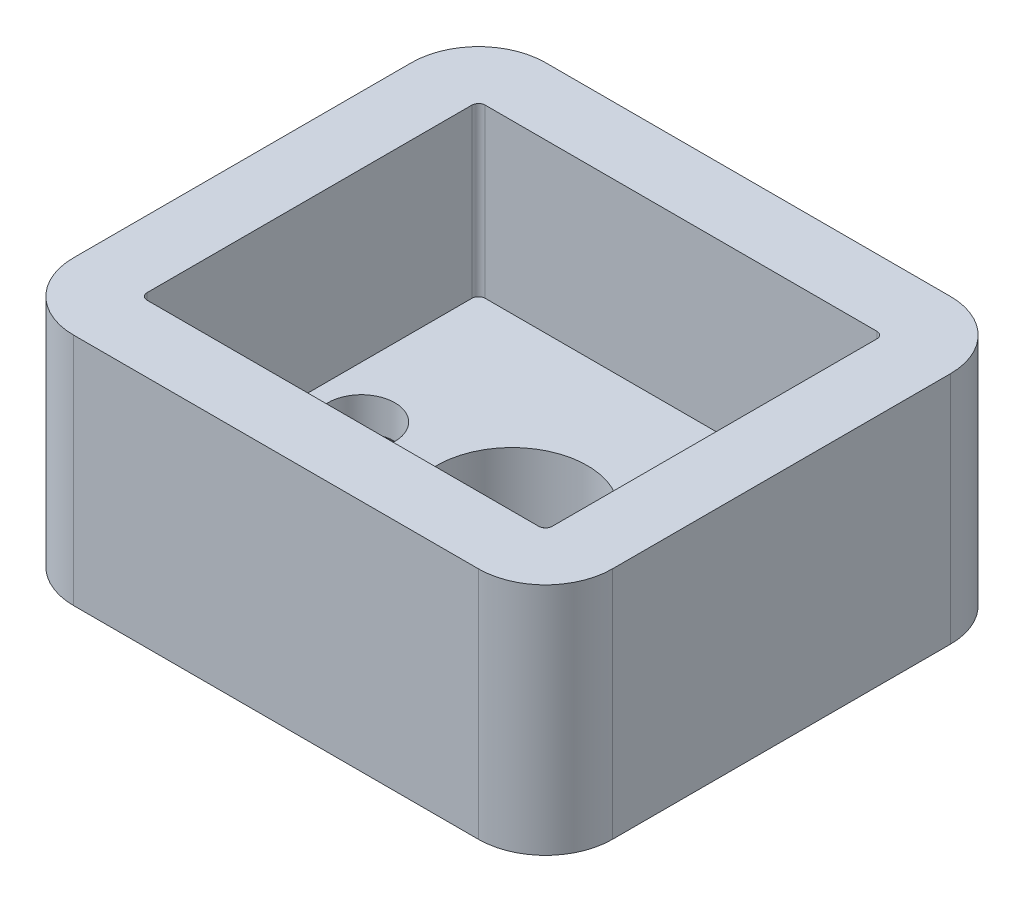
ISO-10303-21;
HEADER;
FILE_DESCRIPTION(('STEP AP214'),'2;1');
FILE_NAME('part.step','',(''),(''),'','','');
FILE_SCHEMA(('AUTOMOTIVE_DESIGN { 1 0 10303 214 1 1 1 1 }'));
ENDSEC;
DATA;
#1=APPLICATION_CONTEXT('core data for automotive mechanical design processes');
#2=APPLICATION_PROTOCOL_DEFINITION('international standard','automotive_design',2000,#1);
#3=PRODUCT_CONTEXT('',#1,'mechanical');
#4=PRODUCT('Part','Part','',(#3));
#5=PRODUCT_RELATED_PRODUCT_CATEGORY('part','',(#4));
#6=PRODUCT_DEFINITION_FORMATION('','',#4);
#7=PRODUCT_DEFINITION_CONTEXT('part definition',#1,'design');
#8=PRODUCT_DEFINITION('design','',#6,#7);
#9=PRODUCT_DEFINITION_SHAPE('','',#8);
#10=(LENGTH_UNIT() NAMED_UNIT(*) SI_UNIT(.MILLI.,.METRE.));
#11=(NAMED_UNIT(*) PLANE_ANGLE_UNIT() SI_UNIT($,.RADIAN.));
#12=(NAMED_UNIT(*) SI_UNIT($,.STERADIAN.) SOLID_ANGLE_UNIT());
#13=UNCERTAINTY_MEASURE_WITH_UNIT(LENGTH_MEASURE(1.E-05),#10,'distance_accuracy_value','');
#14=(GEOMETRIC_REPRESENTATION_CONTEXT(3) GLOBAL_UNCERTAINTY_ASSIGNED_CONTEXT((#13)) GLOBAL_UNIT_ASSIGNED_CONTEXT((#10,
#11,#12)) REPRESENTATION_CONTEXT('',''));
#15=CARTESIAN_POINT('',(0.,0.,0.));
#16=DIRECTION('',(0.,0.,1.));
#17=DIRECTION('',(1.,0.,0.));
#18=AXIS2_PLACEMENT_3D('',#15,#16,#17);
#19=CARTESIAN_POINT('',(0.,0.,0.));
#20=DIRECTION('',(0.,1.,0.));
#21=DIRECTION('',(0.,0.,1.));
#22=AXIS2_PLACEMENT_3D('',#19,#20,#21);
#23=PLANE('',#22);
#24=CARTESIAN_POINT('',(0.,0.,0.));
#25=DIRECTION('',(0.,1.,0.));
#26=DIRECTION('',(0.,0.,1.));
#27=AXIS2_PLACEMENT_3D('',#24,#25,#26);
#28=CIRCLE('',#27,2.25);
#29=CARTESIAN_POINT('',(0.,0.,2.25));
#30=VERTEX_POINT('',#29);
#31=EDGE_CURVE('E622',#30,#30,#28,.T.);
#32=ORIENTED_EDGE('',*,*,#31,.T.);
#33=EDGE_LOOP('',(#32));
#34=FACE_BOUND('',#33,.T.);
#35=DIRECTION('',(0.,0.,1.));
#36=VECTOR('',#35,1.);
#37=CARTESIAN_POINT('',(-8.05,0.,-7.05));
#38=LINE('',#37,#36);
#39=CARTESIAN_POINT('',(-8.05,0.,-5.05));
#40=VERTEX_POINT('',#39);
#41=CARTESIAN_POINT('',(-8.05,0.,5.05));
#42=VERTEX_POINT('',#41);
#43=EDGE_CURVE('E171',#40,#42,#38,.T.);
#44=ORIENTED_EDGE('',*,*,#43,.F.);
#45=CARTESIAN_POINT('',(-6.05,0.,-5.05));
#46=DIRECTION('',(0.,1.,0.));
#47=DIRECTION('',(0.,0.,1.));
#48=AXIS2_PLACEMENT_3D('',#45,#46,#47);
#49=CIRCLE('',#48,2.);
#50=CARTESIAN_POINT('',(-6.05,0.,-7.05));
#51=VERTEX_POINT('',#50);
#52=EDGE_CURVE('E153',#40,#51,#49,.F.);
#53=ORIENTED_EDGE('',*,*,#52,.T.);
#54=DIRECTION('',(-1.,0.,0.));
#55=VECTOR('',#54,1.);
#56=CARTESIAN_POINT('',(-8.05,0.,-7.05));
#57=LINE('',#56,#55);
#58=CARTESIAN_POINT('',(6.05,0.,-7.05));
#59=VERTEX_POINT('',#58);
#60=EDGE_CURVE('E201',#59,#51,#57,.T.);
#61=ORIENTED_EDGE('',*,*,#60,.F.);
#62=CARTESIAN_POINT('',(6.05,0.,-5.05));
#63=DIRECTION('',(0.,1.,0.));
#64=DIRECTION('',(0.,0.,1.));
#65=AXIS2_PLACEMENT_3D('',#62,#63,#64);
#66=CIRCLE('',#65,2.);
#67=CARTESIAN_POINT('',(8.05,0.,-5.05));
#68=VERTEX_POINT('',#67);
#69=EDGE_CURVE('E176',#59,#68,#66,.F.);
#70=ORIENTED_EDGE('',*,*,#69,.T.);
#71=DIRECTION('',(0.,0.,-1.));
#72=VECTOR('',#71,1.);
#73=CARTESIAN_POINT('',(8.05,0.,-7.05));
#74=LINE('',#73,#72);
#75=CARTESIAN_POINT('',(8.05,0.,5.05));
#76=VERTEX_POINT('',#75);
#77=EDGE_CURVE('E189',#76,#68,#74,.T.);
#78=ORIENTED_EDGE('',*,*,#77,.F.);
#79=CARTESIAN_POINT('',(6.05,0.,5.05));
#80=DIRECTION('',(0.,1.,0.));
#81=DIRECTION('',(0.,0.,1.));
#82=AXIS2_PLACEMENT_3D('',#79,#80,#81);
#83=CIRCLE('',#82,2.);
#84=CARTESIAN_POINT('',(6.05,0.,7.05));
#85=VERTEX_POINT('',#84);
#86=EDGE_CURVE('E165',#76,#85,#83,.F.);
#87=ORIENTED_EDGE('',*,*,#86,.T.);
#88=DIRECTION('',(1.,0.,0.));
#89=VECTOR('',#88,1.);
#90=CARTESIAN_POINT('',(-8.05,0.,7.05));
#91=LINE('',#90,#89);
#92=CARTESIAN_POINT('',(-6.05,0.,7.05));
#93=VERTEX_POINT('',#92);
#94=EDGE_CURVE('E183',#93,#85,#91,.T.);
#95=ORIENTED_EDGE('',*,*,#94,.F.);
#96=CARTESIAN_POINT('',(-6.05,0.,5.05));
#97=DIRECTION('',(0.,1.,0.));
#98=DIRECTION('',(0.,0.,1.));
#99=AXIS2_PLACEMENT_3D('',#96,#97,#98);
#100=CIRCLE('',#99,2.);
#101=EDGE_CURVE('E181',#93,#42,#100,.F.);
#102=ORIENTED_EDGE('',*,*,#101,.T.);
#103=EDGE_LOOP('',(#44,#53,#61,#70,#78,#87,#95,#102));
#104=FACE_BOUND('',#103,.T.);
#105=CARTESIAN_POINT('',(4.5,0.,0.));
#106=DIRECTION('',(0.,-1.,0.));
#107=DIRECTION('',(0.,0.,-1.));
#108=AXIS2_PLACEMENT_3D('',#105,#106,#107);
#109=CIRCLE('',#108,2.);
#110=CARTESIAN_POINT('',(4.5,0.,-2.));
#111=VERTEX_POINT('',#110);
#112=EDGE_CURVE('E606',#111,#111,#109,.T.);
#113=ORIENTED_EDGE('',*,*,#112,.F.);
#114=EDGE_LOOP('',(#113));
#115=FACE_BOUND('',#114,.T.);
#116=CARTESIAN_POINT('',(-4.5,0.,0.));
#117=DIRECTION('',(0.,-1.,0.));
#118=DIRECTION('',(0.,0.,-1.));
#119=AXIS2_PLACEMENT_3D('',#116,#117,#118);
#120=CIRCLE('',#119,2.);
#121=CARTESIAN_POINT('',(-4.5,0.,-2.));
#122=VERTEX_POINT('',#121);
#123=EDGE_CURVE('E618',#122,#122,#120,.T.);
#124=ORIENTED_EDGE('',*,*,#123,.F.);
#125=EDGE_LOOP('',(#124));
#126=FACE_BOUND('',#125,.T.);
#127=ADVANCED_FACE('F40',(#34,#104,#115,#126),#23,.F.);
#128=CARTESIAN_POINT('',(-8.05,7.,-7.05));
#129=DIRECTION('',(1.,0.,0.));
#130=DIRECTION('',(0.,0.,-1.));
#131=AXIS2_PLACEMENT_3D('',#128,#129,#130);
#132=PLANE('',#131);
#133=DIRECTION('',(0.,0.,1.));
#134=VECTOR('',#133,1.);
#135=CARTESIAN_POINT('',(-8.05,7.,-7.05));
#136=LINE('',#135,#134);
#137=CARTESIAN_POINT('',(-8.05,7.,-5.05));
#138=VERTEX_POINT('',#137);
#139=CARTESIAN_POINT('',(-8.05,7.,5.05));
#140=VERTEX_POINT('',#139);
#141=EDGE_CURVE('E174',#138,#140,#136,.T.);
#142=ORIENTED_EDGE('',*,*,#141,.F.);
#143=DIRECTION('',(0.,-1.,0.));
#144=VECTOR('',#143,1.);
#145=CARTESIAN_POINT('',(-8.05,7.,-5.05));
#146=LINE('',#145,#144);
#147=EDGE_CURVE('E157',#138,#40,#146,.T.);
#148=ORIENTED_EDGE('',*,*,#147,.T.);
#149=ORIENTED_EDGE('',*,*,#43,.T.);
#150=DIRECTION('',(0.,-1.,0.));
#151=VECTOR('',#150,1.);
#152=CARTESIAN_POINT('',(-8.05,7.,5.05));
#153=LINE('',#152,#151);
#154=EDGE_CURVE('E177',#42,#140,#153,.F.);
#155=ORIENTED_EDGE('',*,*,#154,.T.);
#156=EDGE_LOOP('',(#142,#148,#149,#155));
#157=FACE_BOUND('',#156,.T.);
#158=ADVANCED_FACE('F170',(#157),#132,.F.);
#159=CARTESIAN_POINT('',(-8.05,7.,7.05));
#160=DIRECTION('',(0.,0.,-1.));
#161=DIRECTION('',(-1.,0.,0.));
#162=AXIS2_PLACEMENT_3D('',#159,#160,#161);
#163=PLANE('',#162);
#164=ORIENTED_EDGE('',*,*,#94,.T.);
#165=DIRECTION('',(0.,-1.,0.));
#166=VECTOR('',#165,1.);
#167=CARTESIAN_POINT('',(6.05,7.,7.05));
#168=LINE('',#167,#166);
#169=CARTESIAN_POINT('',(6.05,7.,7.05));
#170=VERTEX_POINT('',#169);
#171=EDGE_CURVE('E240',#85,#170,#168,.F.);
#172=ORIENTED_EDGE('',*,*,#171,.T.);
#173=DIRECTION('',(1.,0.,0.));
#174=VECTOR('',#173,1.);
#175=CARTESIAN_POINT('',(-8.05,7.,7.05));
#176=LINE('',#175,#174);
#177=CARTESIAN_POINT('',(-6.05,7.,7.05));
#178=VERTEX_POINT('',#177);
#179=EDGE_CURVE('E344',#178,#170,#176,.T.);
#180=ORIENTED_EDGE('',*,*,#179,.F.);
#181=DIRECTION('',(0.,-1.,0.));
#182=VECTOR('',#181,1.);
#183=CARTESIAN_POINT('',(-6.05,7.,7.05));
#184=LINE('',#183,#182);
#185=EDGE_CURVE('E236',#178,#93,#184,.T.);
#186=ORIENTED_EDGE('',*,*,#185,.T.);
#187=EDGE_LOOP('',(#164,#172,#180,#186));
#188=FACE_BOUND('',#187,.T.);
#189=ADVANCED_FACE('F370',(#188),#163,.F.);
#190=CARTESIAN_POINT('',(8.05,7.,-7.05));
#191=DIRECTION('',(-1.,0.,0.));
#192=DIRECTION('',(0.,0.,1.));
#193=AXIS2_PLACEMENT_3D('',#190,#191,#192);
#194=PLANE('',#193);
#195=DIRECTION('',(0.,0.,-1.));
#196=VECTOR('',#195,1.);
#197=CARTESIAN_POINT('',(8.05,7.,-7.05));
#198=LINE('',#197,#196);
#199=CARTESIAN_POINT('',(8.05,7.,5.05));
#200=VERTEX_POINT('',#199);
#201=CARTESIAN_POINT('',(8.05,7.,-5.05));
#202=VERTEX_POINT('',#201);
#203=EDGE_CURVE('E347',#200,#202,#198,.T.);
#204=ORIENTED_EDGE('',*,*,#203,.F.);
#205=DIRECTION('',(0.,-1.,0.));
#206=VECTOR('',#205,1.);
#207=CARTESIAN_POINT('',(8.05,7.,5.05));
#208=LINE('',#207,#206);
#209=EDGE_CURVE('E232',#200,#76,#208,.T.);
#210=ORIENTED_EDGE('',*,*,#209,.T.);
#211=ORIENTED_EDGE('',*,*,#77,.T.);
#212=DIRECTION('',(0.,-1.,0.));
#213=VECTOR('',#212,1.);
#214=CARTESIAN_POINT('',(8.05,7.,-5.05));
#215=LINE('',#214,#213);
#216=EDGE_CURVE('E229',#68,#202,#215,.F.);
#217=ORIENTED_EDGE('',*,*,#216,.T.);
#218=EDGE_LOOP('',(#204,#210,#211,#217));
#219=FACE_BOUND('',#218,.T.);
#220=ADVANCED_FACE('F363',(#219),#194,.F.);
#221=CARTESIAN_POINT('',(-8.05,7.,-7.05));
#222=DIRECTION('',(0.,0.,1.));
#223=DIRECTION('',(1.,0.,0.));
#224=AXIS2_PLACEMENT_3D('',#221,#222,#223);
#225=PLANE('',#224);
#226=ORIENTED_EDGE('',*,*,#60,.T.);
#227=DIRECTION('',(0.,-1.,0.));
#228=VECTOR('',#227,1.);
#229=CARTESIAN_POINT('',(-6.05,7.,-7.05));
#230=LINE('',#229,#228);
#231=CARTESIAN_POINT('',(-6.05,7.,-7.05));
#232=VERTEX_POINT('',#231);
#233=EDGE_CURVE('E158',#51,#232,#230,.F.);
#234=ORIENTED_EDGE('',*,*,#233,.T.);
#235=DIRECTION('',(-1.,0.,0.));
#236=VECTOR('',#235,1.);
#237=CARTESIAN_POINT('',(-8.05,7.,-7.05));
#238=LINE('',#237,#236);
#239=CARTESIAN_POINT('',(6.05,7.,-7.05));
#240=VERTEX_POINT('',#239);
#241=EDGE_CURVE('E195',#240,#232,#238,.T.);
#242=ORIENTED_EDGE('',*,*,#241,.F.);
#243=DIRECTION('',(0.,-1.,0.));
#244=VECTOR('',#243,1.);
#245=CARTESIAN_POINT('',(6.05,7.,-7.05));
#246=LINE('',#245,#244);
#247=EDGE_CURVE('E164',#240,#59,#246,.T.);
#248=ORIENTED_EDGE('',*,*,#247,.T.);
#249=EDGE_LOOP('',(#226,#234,#242,#248));
#250=FACE_BOUND('',#249,.T.);
#251=ADVANCED_FACE('F357',(#250),#225,.F.);
#252=CARTESIAN_POINT('',(0.,7.,0.));
#253=DIRECTION('',(0.,1.,0.));
#254=DIRECTION('',(0.,0.,1.));
#255=AXIS2_PLACEMENT_3D('',#252,#253,#254);
#256=PLANE('',#255);
#257=DIRECTION('',(0.,0.,1.));
#258=VECTOR('',#257,1.);
#259=CARTESIAN_POINT('',(-6.05,7.,-5.05));
#260=LINE('',#259,#258);
#261=CARTESIAN_POINT('',(-6.05,7.,-4.85));
#262=VERTEX_POINT('',#261);
#263=CARTESIAN_POINT('',(-6.05,7.,4.85));
#264=VERTEX_POINT('',#263);
#265=EDGE_CURVE('E292',#262,#264,#260,.T.);
#266=ORIENTED_EDGE('',*,*,#265,.F.);
#267=CARTESIAN_POINT('',(-5.85,7.,-4.85));
#268=DIRECTION('',(0.,1.,0.));
#269=DIRECTION('',(0.,0.,1.));
#270=AXIS2_PLACEMENT_3D('',#267,#268,#269);
#271=CIRCLE('',#270,0.2);
#272=CARTESIAN_POINT('',(-5.85,7.,-5.05));
#273=VERTEX_POINT('',#272);
#274=EDGE_CURVE('E282',#262,#273,#271,.F.);
#275=ORIENTED_EDGE('',*,*,#274,.T.);
#276=DIRECTION('',(-1.,0.,0.));
#277=VECTOR('',#276,1.);
#278=CARTESIAN_POINT('',(-6.05,7.,-5.05));
#279=LINE('',#278,#277);
#280=CARTESIAN_POINT('',(5.85,7.,-5.05));
#281=VERTEX_POINT('',#280);
#282=EDGE_CURVE('E324',#281,#273,#279,.T.);
#283=ORIENTED_EDGE('',*,*,#282,.F.);
#284=CARTESIAN_POINT('',(5.85,7.,-4.85));
#285=DIRECTION('',(0.,1.,0.));
#286=DIRECTION('',(0.,0.,1.));
#287=AXIS2_PLACEMENT_3D('',#284,#285,#286);
#288=CIRCLE('',#287,0.2);
#289=CARTESIAN_POINT('',(6.05,7.,-4.85));
#290=VERTEX_POINT('',#289);
#291=EDGE_CURVE('E285',#281,#290,#288,.F.);
#292=ORIENTED_EDGE('',*,*,#291,.T.);
#293=DIRECTION('',(0.,0.,-1.));
#294=VECTOR('',#293,1.);
#295=CARTESIAN_POINT('',(6.05,7.,-5.05));
#296=LINE('',#295,#294);
#297=CARTESIAN_POINT('',(6.05,7.,4.85));
#298=VERTEX_POINT('',#297);
#299=EDGE_CURVE('E331',#298,#290,#296,.T.);
#300=ORIENTED_EDGE('',*,*,#299,.F.);
#301=CARTESIAN_POINT('',(5.85,7.,4.85));
#302=DIRECTION('',(0.,1.,0.));
#303=DIRECTION('',(0.,0.,1.));
#304=AXIS2_PLACEMENT_3D('',#301,#302,#303);
#305=CIRCLE('',#304,0.2);
#306=CARTESIAN_POINT('',(5.85,7.,5.05));
#307=VERTEX_POINT('',#306);
#308=EDGE_CURVE('E12',#298,#307,#305,.F.);
#309=ORIENTED_EDGE('',*,*,#308,.T.);
#310=DIRECTION('',(1.,0.,0.));
#311=VECTOR('',#310,1.);
#312=CARTESIAN_POINT('',(-6.05,7.,5.05));
#313=LINE('',#312,#311);
#314=CARTESIAN_POINT('',(-5.85,7.,5.05));
#315=VERTEX_POINT('',#314);
#316=EDGE_CURVE('E293',#315,#307,#313,.T.);
#317=ORIENTED_EDGE('',*,*,#316,.F.);
#318=CARTESIAN_POINT('',(-5.85,7.,4.85));
#319=DIRECTION('',(0.,1.,0.));
#320=DIRECTION('',(0.,0.,1.));
#321=AXIS2_PLACEMENT_3D('',#318,#319,#320);
#322=CIRCLE('',#321,0.2);
#323=EDGE_CURVE('E49',#315,#264,#322,.F.);
#324=ORIENTED_EDGE('',*,*,#323,.T.);
#325=EDGE_LOOP('',(#266,#275,#283,#292,#300,#309,#317,#324));
#326=FACE_BOUND('',#325,.T.);
#327=ORIENTED_EDGE('',*,*,#241,.T.);
#328=CARTESIAN_POINT('',(-6.05,7.,-5.05));
#329=DIRECTION('',(0.,1.,0.));
#330=DIRECTION('',(0.,0.,1.));
#331=AXIS2_PLACEMENT_3D('',#328,#329,#330);
#332=CIRCLE('',#331,2.);
#333=EDGE_CURVE('E226',#232,#138,#332,.T.);
#334=ORIENTED_EDGE('',*,*,#333,.T.);
#335=ORIENTED_EDGE('',*,*,#141,.T.);
#336=CARTESIAN_POINT('',(-6.05,7.,5.05));
#337=DIRECTION('',(0.,1.,0.));
#338=DIRECTION('',(0.,0.,1.));
#339=AXIS2_PLACEMENT_3D('',#336,#337,#338);
#340=CIRCLE('',#339,2.);
#341=EDGE_CURVE('E220',#140,#178,#340,.T.);
#342=ORIENTED_EDGE('',*,*,#341,.T.);
#343=ORIENTED_EDGE('',*,*,#179,.T.);
#344=CARTESIAN_POINT('',(6.05,7.,5.05));
#345=DIRECTION('',(0.,1.,0.));
#346=DIRECTION('',(0.,0.,1.));
#347=AXIS2_PLACEMENT_3D('',#344,#345,#346);
#348=CIRCLE('',#347,2.);
#349=EDGE_CURVE('E223',#170,#200,#348,.T.);
#350=ORIENTED_EDGE('',*,*,#349,.T.);
#351=ORIENTED_EDGE('',*,*,#203,.T.);
#352=CARTESIAN_POINT('',(6.05,7.,-5.05));
#353=DIRECTION('',(0.,1.,0.));
#354=DIRECTION('',(0.,0.,1.));
#355=AXIS2_PLACEMENT_3D('',#352,#353,#354);
#356=CIRCLE('',#355,2.);
#357=EDGE_CURVE('E217',#202,#240,#356,.T.);
#358=ORIENTED_EDGE('',*,*,#357,.T.);
#359=EDGE_LOOP('',(#327,#334,#335,#342,#343,#350,#351,#358));
#360=FACE_BOUND('',#359,.T.);
#361=ADVANCED_FACE('F290',(#326,#360),#256,.T.);
#362=CARTESIAN_POINT('',(-6.05,-15.7613451202618,-5.05));
#363=DIRECTION('',(-1.,0.,0.));
#364=DIRECTION('',(0.,0.,1.));
#365=AXIS2_PLACEMENT_3D('',#362,#363,#364);
#366=PLANE('',#365);
#367=DIRECTION('',(0.,0.,-1.));
#368=VECTOR('',#367,1.);
#369=CARTESIAN_POINT('',(-6.05,2.,-5.05));
#370=LINE('',#369,#368);
#371=CARTESIAN_POINT('',(-6.05,2.,4.85));
#372=VERTEX_POINT('',#371);
#373=CARTESIAN_POINT('',(-6.05,2.,-4.85));
#374=VERTEX_POINT('',#373);
#375=EDGE_CURVE('E192',#372,#374,#370,.T.);
#376=ORIENTED_EDGE('',*,*,#375,.T.);
#377=DIRECTION('',(0.,1.,0.));
#378=VECTOR('',#377,1.);
#379=CARTESIAN_POINT('',(-6.05,7.,-4.85));
#380=LINE('',#379,#378);
#381=EDGE_CURVE('E246',#374,#262,#380,.T.);
#382=ORIENTED_EDGE('',*,*,#381,.T.);
#383=ORIENTED_EDGE('',*,*,#265,.T.);
#384=DIRECTION('',(0.,1.,0.));
#385=VECTOR('',#384,1.);
#386=CARTESIAN_POINT('',(-6.05,2.,4.85));
#387=LINE('',#386,#385);
#388=EDGE_CURVE('E243',#264,#372,#387,.F.);
#389=ORIENTED_EDGE('',*,*,#388,.T.);
#390=EDGE_LOOP('',(#376,#382,#383,#389));
#391=FACE_BOUND('',#390,.T.);
#392=ADVANCED_FACE('F296',(#391),#366,.F.);
#393=CARTESIAN_POINT('',(-6.05,-15.7613451202618,-5.05));
#394=DIRECTION('',(0.,0.,-1.));
#395=DIRECTION('',(-1.,0.,0.));
#396=AXIS2_PLACEMENT_3D('',#393,#394,#395);
#397=PLANE('',#396);
#398=ORIENTED_EDGE('',*,*,#282,.T.);
#399=DIRECTION('',(0.,1.,0.));
#400=VECTOR('',#399,1.);
#401=CARTESIAN_POINT('',(-5.85,2.,-5.05));
#402=LINE('',#401,#400);
#403=CARTESIAN_POINT('',(-5.85,2.,-5.05));
#404=VERTEX_POINT('',#403);
#405=EDGE_CURVE('E254',#273,#404,#402,.F.);
#406=ORIENTED_EDGE('',*,*,#405,.T.);
#407=DIRECTION('',(1.,0.,0.));
#408=VECTOR('',#407,1.);
#409=CARTESIAN_POINT('',(-6.05,2.,-5.05));
#410=LINE('',#409,#408);
#411=CARTESIAN_POINT('',(5.85,2.,-5.05));
#412=VERTEX_POINT('',#411);
#413=EDGE_CURVE('E323',#404,#412,#410,.T.);
#414=ORIENTED_EDGE('',*,*,#413,.T.);
#415=DIRECTION('',(0.,1.,0.));
#416=VECTOR('',#415,1.);
#417=CARTESIAN_POINT('',(5.85,7.,-5.05));
#418=LINE('',#417,#416);
#419=EDGE_CURVE('E250',#412,#281,#418,.T.);
#420=ORIENTED_EDGE('',*,*,#419,.T.);
#421=EDGE_LOOP('',(#398,#406,#414,#420));
#422=FACE_BOUND('',#421,.T.);
#423=ADVANCED_FACE('F433',(#422),#397,.F.);
#424=CARTESIAN_POINT('',(6.05,-15.7613451202618,-5.05));
#425=DIRECTION('',(1.,0.,0.));
#426=DIRECTION('',(0.,0.,-1.));
#427=AXIS2_PLACEMENT_3D('',#424,#425,#426);
#428=PLANE('',#427);
#429=ORIENTED_EDGE('',*,*,#299,.T.);
#430=DIRECTION('',(0.,1.,0.));
#431=VECTOR('',#430,1.);
#432=CARTESIAN_POINT('',(6.05,2.,-4.85));
#433=LINE('',#432,#431);
#434=CARTESIAN_POINT('',(6.05,2.,-4.85));
#435=VERTEX_POINT('',#434);
#436=EDGE_CURVE('E273',#290,#435,#433,.F.);
#437=ORIENTED_EDGE('',*,*,#436,.T.);
#438=DIRECTION('',(0.,0.,1.));
#439=VECTOR('',#438,1.);
#440=CARTESIAN_POINT('',(6.05,2.,-5.05));
#441=LINE('',#440,#439);
#442=CARTESIAN_POINT('',(6.05,2.,4.85));
#443=VERTEX_POINT('',#442);
#444=EDGE_CURVE('E316',#435,#443,#441,.T.);
#445=ORIENTED_EDGE('',*,*,#444,.T.);
#446=DIRECTION('',(0.,1.,0.));
#447=VECTOR('',#446,1.);
#448=CARTESIAN_POINT('',(6.05,7.,4.85));
#449=LINE('',#448,#447);
#450=EDGE_CURVE('E269',#443,#298,#449,.T.);
#451=ORIENTED_EDGE('',*,*,#450,.T.);
#452=EDGE_LOOP('',(#429,#437,#445,#451));
#453=FACE_BOUND('',#452,.T.);
#454=ADVANCED_FACE('F320',(#453),#428,.F.);
#455=CARTESIAN_POINT('',(-6.05,-15.7613451202618,5.05));
#456=DIRECTION('',(0.,0.,1.));
#457=DIRECTION('',(1.,0.,0.));
#458=AXIS2_PLACEMENT_3D('',#455,#456,#457);
#459=PLANE('',#458);
#460=DIRECTION('',(-1.,0.,0.));
#461=VECTOR('',#460,1.);
#462=CARTESIAN_POINT('',(-6.05,2.,5.05));
#463=LINE('',#462,#461);
#464=CARTESIAN_POINT('',(5.85,2.,5.05));
#465=VERTEX_POINT('',#464);
#466=CARTESIAN_POINT('',(-5.85,2.,5.05));
#467=VERTEX_POINT('',#466);
#468=EDGE_CURVE('E184',#465,#467,#463,.T.);
#469=ORIENTED_EDGE('',*,*,#468,.T.);
#470=DIRECTION('',(0.,1.,0.));
#471=VECTOR('',#470,1.);
#472=CARTESIAN_POINT('',(-5.85,7.,5.05));
#473=LINE('',#472,#471);
#474=EDGE_CURVE('E279',#467,#315,#473,.T.);
#475=ORIENTED_EDGE('',*,*,#474,.T.);
#476=ORIENTED_EDGE('',*,*,#316,.T.);
#477=DIRECTION('',(0.,1.,0.));
#478=VECTOR('',#477,1.);
#479=CARTESIAN_POINT('',(5.85,2.,5.05));
#480=LINE('',#479,#478);
#481=EDGE_CURVE('E276',#307,#465,#480,.F.);
#482=ORIENTED_EDGE('',*,*,#481,.T.);
#483=EDGE_LOOP('',(#469,#475,#476,#482));
#484=FACE_BOUND('',#483,.T.);
#485=ADVANCED_FACE('F310',(#484),#459,.F.);
#486=CARTESIAN_POINT('',(0.,2.,0.));
#487=DIRECTION('',(0.,1.,0.));
#488=DIRECTION('',(0.,0.,1.));
#489=AXIS2_PLACEMENT_3D('',#486,#487,#488);
#490=PLANE('',#489);
#491=CARTESIAN_POINT('',(0.,2.,0.));
#492=DIRECTION('',(0.,1.,0.));
#493=DIRECTION('',(0.,0.,1.));
#494=AXIS2_PLACEMENT_3D('',#491,#492,#493);
#495=CIRCLE('',#494,2.25);
#496=CARTESIAN_POINT('',(0.,2.,2.25));
#497=VERTEX_POINT('',#496);
#498=EDGE_CURVE('E594',#497,#497,#495,.T.);
#499=ORIENTED_EDGE('',*,*,#498,.F.);
#500=EDGE_LOOP('',(#499));
#501=FACE_BOUND('',#500,.T.);
#502=CARTESIAN_POINT('',(-4.5,2.,0.));
#503=DIRECTION('',(0.,1.,0.));
#504=DIRECTION('',(0.,0.,1.));
#505=AXIS2_PLACEMENT_3D('',#502,#503,#504);
#506=CIRCLE('',#505,0.999999999999999);
#507=CARTESIAN_POINT('',(-4.5,2.,0.999999999999999));
#508=VERTEX_POINT('',#507);
#509=EDGE_CURVE('E598',#508,#508,#506,.T.);
#510=ORIENTED_EDGE('',*,*,#509,.F.);
#511=EDGE_LOOP('',(#510));
#512=FACE_BOUND('',#511,.T.);
#513=CARTESIAN_POINT('',(4.5,2.,0.));
#514=DIRECTION('',(0.,1.,0.));
#515=DIRECTION('',(0.,0.,1.));
#516=AXIS2_PLACEMENT_3D('',#513,#514,#515);
#517=CIRCLE('',#516,0.999999999999999);
#518=CARTESIAN_POINT('',(4.5,2.,0.999999999999999));
#519=VERTEX_POINT('',#518);
#520=EDGE_CURVE('E300',#519,#519,#517,.T.);
#521=ORIENTED_EDGE('',*,*,#520,.F.);
#522=EDGE_LOOP('',(#521));
#523=FACE_BOUND('',#522,.T.);
#524=ORIENTED_EDGE('',*,*,#413,.F.);
#525=CARTESIAN_POINT('',(-5.85,2.,-4.85));
#526=DIRECTION('',(0.,1.,0.));
#527=DIRECTION('',(0.,0.,1.));
#528=AXIS2_PLACEMENT_3D('',#525,#526,#527);
#529=CIRCLE('',#528,0.2);
#530=EDGE_CURVE('E266',#404,#374,#529,.T.);
#531=ORIENTED_EDGE('',*,*,#530,.T.);
#532=ORIENTED_EDGE('',*,*,#375,.F.);
#533=CARTESIAN_POINT('',(-5.85,2.,4.85));
#534=DIRECTION('',(0.,1.,0.));
#535=DIRECTION('',(0.,0.,1.));
#536=AXIS2_PLACEMENT_3D('',#533,#534,#535);
#537=CIRCLE('',#536,0.2);
#538=EDGE_CURVE('E260',#372,#467,#537,.T.);
#539=ORIENTED_EDGE('',*,*,#538,.T.);
#540=ORIENTED_EDGE('',*,*,#468,.F.);
#541=CARTESIAN_POINT('',(5.85,2.,4.85));
#542=DIRECTION('',(0.,1.,0.));
#543=DIRECTION('',(0.,0.,1.));
#544=AXIS2_PLACEMENT_3D('',#541,#542,#543);
#545=CIRCLE('',#544,0.2);
#546=EDGE_CURVE('E257',#465,#443,#545,.T.);
#547=ORIENTED_EDGE('',*,*,#546,.T.);
#548=ORIENTED_EDGE('',*,*,#444,.F.);
#549=CARTESIAN_POINT('',(5.85,2.,-4.85));
#550=DIRECTION('',(0.,1.,0.));
#551=DIRECTION('',(0.,0.,1.));
#552=AXIS2_PLACEMENT_3D('',#549,#550,#551);
#553=CIRCLE('',#552,0.2);
#554=EDGE_CURVE('E263',#435,#412,#553,.T.);
#555=ORIENTED_EDGE('',*,*,#554,.T.);
#556=EDGE_LOOP('',(#524,#531,#532,#539,#540,#547,#548,#555));
#557=FACE_BOUND('',#556,.T.);
#558=ADVANCED_FACE('F307',(#501,#512,#523,#557),#490,.T.);
#559=CARTESIAN_POINT('',(4.5,0.,0.));
#560=DIRECTION('',(0.,-1.,0.));
#561=DIRECTION('',(0.,0.,-1.));
#562=AXIS2_PLACEMENT_3D('',#559,#560,#561);
#563=CYLINDRICAL_SURFACE('',#562,0.999999999999999);
#564=CARTESIAN_POINT('',(4.5,1.,0.));
#565=DIRECTION('',(0.,-1.,0.));
#566=DIRECTION('',(0.,0.,-1.));
#567=AXIS2_PLACEMENT_3D('',#564,#565,#566);
#568=CIRCLE('',#567,0.999999999999999);
#569=CARTESIAN_POINT('',(4.5,1.,-0.999999999999999));
#570=VERTEX_POINT('',#569);
#571=EDGE_CURVE('E603',#570,#570,#568,.T.);
#572=ORIENTED_EDGE('',*,*,#571,.T.);
#573=EDGE_LOOP('',(#572));
#574=FACE_BOUND('',#573,.T.);
#575=ORIENTED_EDGE('',*,*,#520,.T.);
#576=EDGE_LOOP('',(#575));
#577=FACE_BOUND('',#576,.T.);
#578=ADVANCED_FACE('F425',(#574,#577),#563,.F.);
#579=CARTESIAN_POINT('',(4.5,0.,0.));
#580=DIRECTION('',(0.,-1.,0.));
#581=DIRECTION('',(0.,0.,-1.));
#582=AXIS2_PLACEMENT_3D('',#579,#580,#581);
#583=CONICAL_SURFACE('',#582,2.,0.785398163397449);
#584=ORIENTED_EDGE('',*,*,#571,.F.);
#585=EDGE_LOOP('',(#584));
#586=FACE_BOUND('',#585,.T.);
#587=ORIENTED_EDGE('',*,*,#112,.T.);
#588=EDGE_LOOP('',(#587));
#589=FACE_BOUND('',#588,.T.);
#590=ADVANCED_FACE('F421',(#586,#589),#583,.F.);
#591=CARTESIAN_POINT('',(-4.5,0.,0.));
#592=DIRECTION('',(0.,-1.,0.));
#593=DIRECTION('',(0.,0.,-1.));
#594=AXIS2_PLACEMENT_3D('',#591,#592,#593);
#595=CYLINDRICAL_SURFACE('',#594,0.999999999999999);
#596=CARTESIAN_POINT('',(-4.5,1.,0.));
#597=DIRECTION('',(0.,-1.,0.));
#598=DIRECTION('',(0.,0.,-1.));
#599=AXIS2_PLACEMENT_3D('',#596,#597,#598);
#600=CIRCLE('',#599,0.999999999999999);
#601=CARTESIAN_POINT('',(-4.5,1.,-0.999999999999999));
#602=VERTEX_POINT('',#601);
#603=EDGE_CURVE('E614',#602,#602,#600,.T.);
#604=ORIENTED_EDGE('',*,*,#603,.T.);
#605=EDGE_LOOP('',(#604));
#606=FACE_BOUND('',#605,.T.);
#607=ORIENTED_EDGE('',*,*,#509,.T.);
#608=EDGE_LOOP('',(#607));
#609=FACE_BOUND('',#608,.T.);
#610=ADVANCED_FACE('F413',(#606,#609),#595,.F.);
#611=CARTESIAN_POINT('',(-4.5,0.,0.));
#612=DIRECTION('',(0.,-1.,0.));
#613=DIRECTION('',(0.,0.,-1.));
#614=AXIS2_PLACEMENT_3D('',#611,#612,#613);
#615=CONICAL_SURFACE('',#614,2.,0.785398163397449);
#616=ORIENTED_EDGE('',*,*,#603,.F.);
#617=EDGE_LOOP('',(#616));
#618=FACE_BOUND('',#617,.T.);
#619=ORIENTED_EDGE('',*,*,#123,.T.);
#620=EDGE_LOOP('',(#619));
#621=FACE_BOUND('',#620,.T.);
#622=ADVANCED_FACE('F407',(#618,#621),#615,.F.);
#623=CARTESIAN_POINT('',(0.,0.,0.));
#624=DIRECTION('',(0.,1.,0.));
#625=DIRECTION('',(0.,0.,1.));
#626=AXIS2_PLACEMENT_3D('',#623,#624,#625);
#627=CYLINDRICAL_SURFACE('',#626,2.25);
#628=ORIENTED_EDGE('',*,*,#31,.F.);
#629=EDGE_LOOP('',(#628));
#630=FACE_BOUND('',#629,.T.);
#631=ORIENTED_EDGE('',*,*,#498,.T.);
#632=EDGE_LOOP('',(#631));
#633=FACE_BOUND('',#632,.T.);
#634=ADVANCED_FACE('F403',(#630,#633),#627,.F.);
#635=CARTESIAN_POINT('',(-6.05,7.,-5.05));
#636=DIRECTION('',(0.,-1.,0.));
#637=DIRECTION('',(0.,0.,-1.));
#638=AXIS2_PLACEMENT_3D('',#635,#636,#637);
#639=CYLINDRICAL_SURFACE('',#638,2.);
#640=ORIENTED_EDGE('',*,*,#333,.F.);
#641=ORIENTED_EDGE('',*,*,#233,.F.);
#642=ORIENTED_EDGE('',*,*,#52,.F.);
#643=ORIENTED_EDGE('',*,*,#147,.F.);
#644=EDGE_LOOP('',(#640,#641,#642,#643));
#645=FACE_BOUND('',#644,.T.);
#646=ADVANCED_FACE('F156',(#645),#639,.T.);
#647=CARTESIAN_POINT('',(6.05,7.,5.05));
#648=DIRECTION('',(0.,-1.,0.));
#649=DIRECTION('',(0.,0.,-1.));
#650=AXIS2_PLACEMENT_3D('',#647,#648,#649);
#651=CYLINDRICAL_SURFACE('',#650,2.);
#652=ORIENTED_EDGE('',*,*,#349,.F.);
#653=ORIENTED_EDGE('',*,*,#171,.F.);
#654=ORIENTED_EDGE('',*,*,#86,.F.);
#655=ORIENTED_EDGE('',*,*,#209,.F.);
#656=EDGE_LOOP('',(#652,#653,#654,#655));
#657=FACE_BOUND('',#656,.T.);
#658=ADVANCED_FACE('F367',(#657),#651,.T.);
#659=CARTESIAN_POINT('',(-6.05,7.,5.05));
#660=DIRECTION('',(0.,-1.,0.));
#661=DIRECTION('',(0.,0.,-1.));
#662=AXIS2_PLACEMENT_3D('',#659,#660,#661);
#663=CYLINDRICAL_SURFACE('',#662,2.);
#664=ORIENTED_EDGE('',*,*,#341,.F.);
#665=ORIENTED_EDGE('',*,*,#154,.F.);
#666=ORIENTED_EDGE('',*,*,#101,.F.);
#667=ORIENTED_EDGE('',*,*,#185,.F.);
#668=EDGE_LOOP('',(#664,#665,#666,#667));
#669=FACE_BOUND('',#668,.T.);
#670=ADVANCED_FACE('F375',(#669),#663,.T.);
#671=CARTESIAN_POINT('',(6.05,7.,-5.05));
#672=DIRECTION('',(0.,-1.,0.));
#673=DIRECTION('',(0.,0.,-1.));
#674=AXIS2_PLACEMENT_3D('',#671,#672,#673);
#675=CYLINDRICAL_SURFACE('',#674,2.);
#676=ORIENTED_EDGE('',*,*,#357,.F.);
#677=ORIENTED_EDGE('',*,*,#216,.F.);
#678=ORIENTED_EDGE('',*,*,#69,.F.);
#679=ORIENTED_EDGE('',*,*,#247,.F.);
#680=EDGE_LOOP('',(#676,#677,#678,#679));
#681=FACE_BOUND('',#680,.T.);
#682=ADVANCED_FACE('F359',(#681),#675,.T.);
#683=CARTESIAN_POINT('',(-5.85,-15.7613451202618,-4.85));
#684=DIRECTION('',(0.,-1.,0.));
#685=DIRECTION('',(0.,0.,-1.));
#686=AXIS2_PLACEMENT_3D('',#683,#684,#685);
#687=CYLINDRICAL_SURFACE('',#686,0.2);
#688=ORIENTED_EDGE('',*,*,#530,.F.);
#689=ORIENTED_EDGE('',*,*,#405,.F.);
#690=ORIENTED_EDGE('',*,*,#274,.F.);
#691=ORIENTED_EDGE('',*,*,#381,.F.);
#692=EDGE_LOOP('',(#688,#689,#690,#691));
#693=FACE_BOUND('',#692,.T.);
#694=ADVANCED_FACE('F382',(#693),#687,.F.);
#695=CARTESIAN_POINT('',(5.85,-15.7613451202618,-4.85));
#696=DIRECTION('',(0.,-1.,0.));
#697=DIRECTION('',(0.,0.,-1.));
#698=AXIS2_PLACEMENT_3D('',#695,#696,#697);
#699=CYLINDRICAL_SURFACE('',#698,0.2);
#700=ORIENTED_EDGE('',*,*,#554,.F.);
#701=ORIENTED_EDGE('',*,*,#436,.F.);
#702=ORIENTED_EDGE('',*,*,#291,.F.);
#703=ORIENTED_EDGE('',*,*,#419,.F.);
#704=EDGE_LOOP('',(#700,#701,#702,#703));
#705=FACE_BOUND('',#704,.T.);
#706=ADVANCED_FACE('F541',(#705),#699,.F.);
#707=CARTESIAN_POINT('',(-5.85,-15.7613451202618,4.85));
#708=DIRECTION('',(0.,-1.,0.));
#709=DIRECTION('',(0.,0.,-1.));
#710=AXIS2_PLACEMENT_3D('',#707,#708,#709);
#711=CYLINDRICAL_SURFACE('',#710,0.2);
#712=ORIENTED_EDGE('',*,*,#538,.F.);
#713=ORIENTED_EDGE('',*,*,#388,.F.);
#714=ORIENTED_EDGE('',*,*,#323,.F.);
#715=ORIENTED_EDGE('',*,*,#474,.F.);
#716=EDGE_LOOP('',(#712,#713,#714,#715));
#717=FACE_BOUND('',#716,.T.);
#718=ADVANCED_FACE('F303',(#717),#711,.F.);
#719=CARTESIAN_POINT('',(5.85,-15.7613451202618,4.85));
#720=DIRECTION('',(0.,-1.,0.));
#721=DIRECTION('',(0.,0.,-1.));
#722=AXIS2_PLACEMENT_3D('',#719,#720,#721);
#723=CYLINDRICAL_SURFACE('',#722,0.2);
#724=ORIENTED_EDGE('',*,*,#546,.F.);
#725=ORIENTED_EDGE('',*,*,#481,.F.);
#726=ORIENTED_EDGE('',*,*,#308,.F.);
#727=ORIENTED_EDGE('',*,*,#450,.F.);
#728=EDGE_LOOP('',(#724,#725,#726,#727));
#729=FACE_BOUND('',#728,.T.);
#730=ADVANCED_FACE('F42',(#729),#723,.F.);
#731=CLOSED_SHELL('',(#127,#158,#189,#220,#251,#361,#392,#423,#454,#485,#558,#578,#590,#610,
#622,#634,#646,#658,#670,#682,#694,#706,#718,#730));
#732=MANIFOLD_SOLID_BREP('B2',#731);
#733=ADVANCED_BREP_SHAPE_REPRESENTATION('',(#18,#732),#14);
#734=SHAPE_DEFINITION_REPRESENTATION(#9,#733);
ENDSEC;
END-ISO-10303-21;
